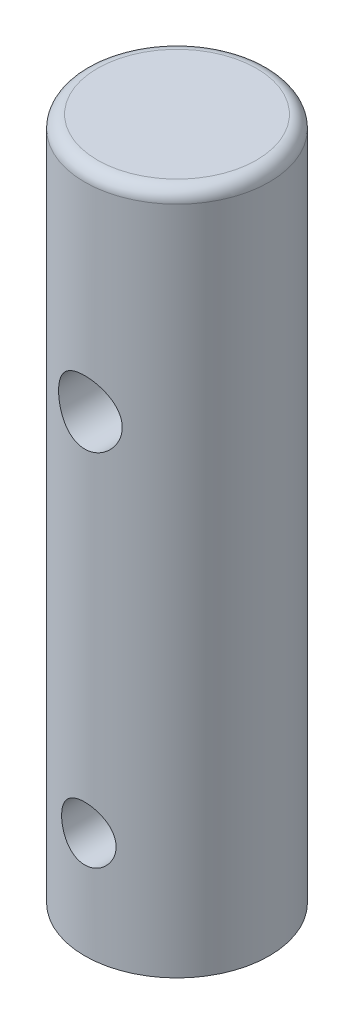
ISO-10303-21;
HEADER;
FILE_DESCRIPTION(('STEP AP214'),'2;1');
FILE_NAME('part.step','',(''),(''),'','','');
FILE_SCHEMA(('AUTOMOTIVE_DESIGN { 1 0 10303 214 1 1 1 1 }'));
ENDSEC;
DATA;
#1=APPLICATION_CONTEXT('core data for automotive mechanical design processes');
#2=APPLICATION_PROTOCOL_DEFINITION('international standard','automotive_design',2000,#1);
#3=PRODUCT_CONTEXT('',#1,'mechanical');
#4=PRODUCT('Part','Part','',(#3));
#5=PRODUCT_RELATED_PRODUCT_CATEGORY('part','',(#4));
#6=PRODUCT_DEFINITION_FORMATION('','',#4);
#7=PRODUCT_DEFINITION_CONTEXT('part definition',#1,'design');
#8=PRODUCT_DEFINITION('design','',#6,#7);
#9=PRODUCT_DEFINITION_SHAPE('','',#8);
#10=(LENGTH_UNIT() NAMED_UNIT(*) SI_UNIT(.MILLI.,.METRE.));
#11=(NAMED_UNIT(*) PLANE_ANGLE_UNIT() SI_UNIT($,.RADIAN.));
#12=(NAMED_UNIT(*) SI_UNIT($,.STERADIAN.) SOLID_ANGLE_UNIT());
#13=UNCERTAINTY_MEASURE_WITH_UNIT(LENGTH_MEASURE(1.E-05),#10,'distance_accuracy_value','');
#14=(GEOMETRIC_REPRESENTATION_CONTEXT(3) GLOBAL_UNCERTAINTY_ASSIGNED_CONTEXT((#13)) GLOBAL_UNIT_ASSIGNED_CONTEXT((#10,
#11,#12)) REPRESENTATION_CONTEXT('',''));
#15=CARTESIAN_POINT('',(0.,0.,0.));
#16=DIRECTION('',(0.,0.,1.));
#17=DIRECTION('',(1.,0.,0.));
#18=AXIS2_PLACEMENT_3D('',#15,#16,#17);
#19=CARTESIAN_POINT('',(0.,40.894,0.));
#20=DIRECTION('',(0.,-1.,0.));
#21=DIRECTION('',(0.,0.,-1.));
#22=AXIS2_PLACEMENT_3D('',#19,#20,#21);
#23=CYLINDRICAL_SURFACE('',#22,5.5245);
#24=CARTESIAN_POINT('',(0.,40.132,0.));
#25=DIRECTION('',(0.,1.,0.));
#26=DIRECTION('',(0.,0.,1.));
#27=AXIS2_PLACEMENT_3D('',#24,#25,#26);
#28=CIRCLE('',#27,5.5245);
#29=CARTESIAN_POINT('',(0.,40.132,5.5245));
#30=VERTEX_POINT('',#29);
#31=EDGE_CURVE('E10',#30,#30,#28,.F.);
#32=ORIENTED_EDGE('',*,*,#31,.T.);
#33=EDGE_LOOP('',(#32));
#34=FACE_BOUND('',#33,.T.);
#35=CARTESIAN_POINT('',(0.,7.98195,-5.5245));
#36=CARTESIAN_POINT('',(-0.0895903484566236,7.98194874623388,-5.52449912660964));
#37=CARTESIAN_POINT('',(-0.179193412250744,7.97454803541203,-5.52229975764123));
#38=CARTESIAN_POINT('',(-0.355794227506304,7.94520838994903,-5.51374071132154));
#39=CARTESIAN_POINT('',(-0.442791124452737,7.92326474031101,-5.50737968471904));
#40=CARTESIAN_POINT('',(-0.611606634543519,7.86563289288612,-5.49119505767326));
#41=CARTESIAN_POINT('',(-0.69343255204608,7.8299646112906,-5.48137647632618));
#42=CARTESIAN_POINT('',(-0.849942205269403,7.74597655108171,-5.45929970758308));
#43=CARTESIAN_POINT('',(-0.924625054389767,7.69765520474004,-5.44704121792499));
#44=CARTESIAN_POINT('',(-1.06681399348117,7.58831050966325,-5.42101173660955));
#45=CARTESIAN_POINT('',(-1.13409241968527,7.5269983359635,-5.40721046505941));
#46=CARTESIAN_POINT('',(-1.25757732244764,7.39402824090718,-5.37983346958253));
#47=CARTESIAN_POINT('',(-1.31378200386905,7.32236864541348,-5.3662577825508));
#48=CARTESIAN_POINT('',(-1.41470912789974,7.16882735481731,-5.34055027390758));
#49=CARTESIAN_POINT('',(-1.45915601002866,7.08675761986931,-5.3284561665612));
#50=CARTESIAN_POINT('',(-1.53352546951408,6.91589382022782,-5.30753267185843));
#51=CARTESIAN_POINT('',(-1.5634514150758,6.8271013204432,-5.2987025275225));
#52=CARTESIAN_POINT('',(-1.60711292071461,6.6478641761065,-5.28562186768113));
#53=CARTESIAN_POINT('',(-1.62126723149235,6.55753039045753,-5.28125317486328));
#54=CARTESIAN_POINT('',(-1.63429101074565,6.37567283272877,-5.2772382670734));
#55=CARTESIAN_POINT('',(-1.63316405629336,6.28414934414841,-5.27759094691184));
#56=CARTESIAN_POINT('',(-1.61598671093425,6.10589531509218,-5.28287404723522));
#57=CARTESIAN_POINT('',(-1.60045826886659,6.01910895050689,-5.2876443522315));
#58=CARTESIAN_POINT('',(-1.55576098148209,5.849432539313,-5.30096656046743));
#59=CARTESIAN_POINT('',(-1.52659082695092,5.76654286751596,-5.30951882666292));
#60=CARTESIAN_POINT('',(-1.45504791724168,5.60572409361142,-5.32957095765642));
#61=CARTESIAN_POINT('',(-1.41250393047487,5.52787608935636,-5.34110868713405));
#62=CARTESIAN_POINT('',(-1.31554008654386,5.38024806309769,-5.36581322533797));
#63=CARTESIAN_POINT('',(-1.26111742700479,5.31046995086757,-5.37898041816358));
#64=CARTESIAN_POINT('',(-1.13933778201114,5.17799878037697,-5.40611212787313));
#65=CARTESIAN_POINT('',(-1.07154687298471,5.11570615040467,-5.42008735932689));
#66=CARTESIAN_POINT('',(-0.926307084519885,5.00328188245886,-5.44678802250402));
#67=CARTESIAN_POINT('',(-0.84885763390005,4.95315096421471,-5.45951338023343));
#68=CARTESIAN_POINT('',(-0.68578714756461,4.86623991525815,-5.48239077524258));
#69=CARTESIAN_POINT('',(-0.600117521736954,4.82954624011543,-5.49252602594894));
#70=CARTESIAN_POINT('',(-0.423454618141935,4.77120493356093,-5.5089602865092));
#71=CARTESIAN_POINT('',(-0.332462785577033,4.749553237996,-5.51526033253006));
#72=CARTESIAN_POINT('',(-0.151144405794774,4.72257164333591,-5.52315147973728));
#73=CARTESIAN_POINT('',(-0.0609053434504533,4.71669881288859,-5.52489915521533));
#74=CARTESIAN_POINT('',(0.119273647976084,4.71992312878111,-5.52394667327806));
#75=CARTESIAN_POINT('',(0.209213614159698,4.7290183432845,-5.52124708984394));
#76=CARTESIAN_POINT('',(0.384208223187774,4.76148053968159,-5.51180574576735));
#77=CARTESIAN_POINT('',(0.469326604712223,4.78453235260241,-5.50515330870802));
#78=CARTESIAN_POINT('',(0.634470770225199,4.8438761111199,-5.48857364613341));
#79=CARTESIAN_POINT('',(0.714495947756585,4.88016962997969,-5.47864603150374));
#80=CARTESIAN_POINT('',(0.869196035704718,4.9658915344128,-5.45626704640769));
#81=CARTESIAN_POINT('',(0.943708592248774,5.0155989533069,-5.44376357925183));
#82=CARTESIAN_POINT('',(1.08352063021712,5.12639696315597,-5.41767015135985));
#83=CARTESIAN_POINT('',(1.14881786464982,5.18749032197106,-5.40407992689854));
#84=CARTESIAN_POINT('',(1.27072204184429,5.32187517857024,-5.3767471625881));
#85=CARTESIAN_POINT('',(1.32694305248801,5.39551983501265,-5.36301604731576));
#86=CARTESIAN_POINT('',(1.42625325065587,5.55149604456448,-5.33746576977812));
#87=CARTESIAN_POINT('',(1.46934282339433,5.6338273427535,-5.32564655143158));
#88=CARTESIAN_POINT('',(1.54086484539621,5.80454940111917,-5.30539529477114));
#89=CARTESIAN_POINT('',(1.56936900727342,5.89290804543329,-5.29694672995955));
#90=CARTESIAN_POINT('',(1.61101392076986,6.07346558847513,-5.28443150847732));
#91=CARTESIAN_POINT('',(1.6241597349503,6.16566321137897,-5.28036340791204));
#92=CARTESIAN_POINT('',(1.63437785206429,6.34728108697358,-5.27720894785441));
#93=CARTESIAN_POINT('',(1.6320779140555,6.43666311229575,-5.27792801377349));
#94=CARTESIAN_POINT('',(1.61296218494905,6.6137052166403,-5.28380081233532));
#95=CARTESIAN_POINT('',(1.59614694254768,6.70136536062381,-5.28895437734856));
#96=CARTESIAN_POINT('',(1.54887757067411,6.87148343103543,-5.30298699744919));
#97=CARTESIAN_POINT('',(1.5185848630738,6.95399012135764,-5.31182188352508));
#98=CARTESIAN_POINT('',(1.44534578337402,7.112815766237,-5.33221476271967));
#99=CARTESIAN_POINT('',(1.40239704715864,7.18913356132381,-5.34377326452239));
#100=CARTESIAN_POINT('',(1.30328174668514,7.33634035236967,-5.36882240205386));
#101=CARTESIAN_POINT('',(1.24670065709829,7.40694106629977,-5.38236699835942));
#102=CARTESIAN_POINT('',(1.12267894761893,7.53784923570666,-5.40959488469815));
#103=CARTESIAN_POINT('',(1.05523553958618,7.59815404022009,-5.4232782094929));
#104=CARTESIAN_POINT('',(0.90912476711559,7.7084410748599,-5.44970175685318));
#105=CARTESIAN_POINT('',(0.830195669922848,7.75808637249882,-5.46240476727729));
#106=CARTESIAN_POINT('',(0.664735691745805,7.84333111593935,-5.48499589435999));
#107=CARTESIAN_POINT('',(0.578208590267892,7.87893749732299,-5.49488540028732));
#108=CARTESIAN_POINT('',(0.410309959670478,7.93168767932821,-5.50981071016908));
#109=CARTESIAN_POINT('',(0.329493165368894,7.95048607989755,-5.51527447789911));
#110=CARTESIAN_POINT('',(0.165787660001949,7.9756168500716,-5.52261924805068));
#111=CARTESIAN_POINT('',(0.0828992734842595,7.98195116012833,-5.524500808161));
#112=CARTESIAN_POINT('',(0.,7.98195,-5.5245));
#113=B_SPLINE_CURVE_WITH_KNOTS('',3,(#35,#36,#37,#38,#39,#40,#41,#42,#43,#44,#45,#46,#47,#48,
#49,#50,#51,#52,#53,#54,#55,#56,#57,#58,#59,#60,#61,#62,#63,#64,#65,#66,#67,#68,#69,#70,#71,#72,
#73,#74,#75,#76,#77,#78,#79,#80,#81,#82,#83,#84,#85,#86,#87,#88,#89,#90,#91,#92,#93,#94,#95,#96,
#97,#98,#99,#100,#101,#102,#103,#104,#105,#106,#107,#108,#109,#110,#111,#112),.UNSPECIFIED.,.T.,
.F.,(4,2,2,2,2,2,2,2,2,2,2,2,2,2,2,2,2,2,2,2,2,2,2,2,2,2,2,2,2,2,2,2,2,2,2,2,2,2,4),(0.,
0.268466610030114,0.537020302794149,0.805185750697699,1.0733844403228,1.34832660222849,
1.62331329771028,1.90426581536578,2.18515313346344,2.45839042798023,2.73156376361527,
2.99520793368555,3.25887741125154,3.52607060424427,3.79332690078291,4.07138671690104,
4.34946298457029,4.62929821029588,4.90905779863716,5.17905996078972,5.44902727810326,
5.71311442386434,5.977232956362,6.24733717515489,6.51750714066475,6.79716935210383,
7.07682335878568,7.35508883995923,7.6332625707779,7.90020095003521,8.1671292391364,
8.43094312171328,8.69480631536583,8.96802156862362,9.24130706287506,9.52225694516128,
9.80306785662084,10.0515226619053,10.2999387838389),.UNSPECIFIED.);
#114=CARTESIAN_POINT('',(0.,7.98195,-5.5245));
#115=VERTEX_POINT('',#114);
#116=EDGE_CURVE('E43',#115,#115,#113,.T.);
#117=ORIENTED_EDGE('',*,*,#116,.T.);
#118=EDGE_LOOP('',(#117));
#119=FACE_BOUND('',#118,.T.);
#120=CARTESIAN_POINT('',(1.63195,6.35,5.27795788610519));
#121=CARTESIAN_POINT('',(1.63194871591318,6.26050591451628,5.27795892790005));
#122=CARTESIAN_POINT('',(1.6245633397231,6.17099906953886,5.28025901185322));
#123=CARTESIAN_POINT('',(1.59529011946661,5.9945976039874,5.28917544304377));
#124=CARTESIAN_POINT('',(1.57339708958734,5.90770392911531,5.29579333368359));
#125=CARTESIAN_POINT('',(1.51591310350462,5.73910769452066,5.31253186673363));
#126=CARTESIAN_POINT('',(1.4803444135311,5.65739694676972,5.32264681267672));
#127=CARTESIAN_POINT('',(1.39659149463591,5.50108335131985,5.34523211331702));
#128=CARTESIAN_POINT('',(1.34840550284489,5.42648149885264,5.35770279708629));
#129=CARTESIAN_POINT('',(1.2392030677595,5.28421432601246,5.38402354564152));
#130=CARTESIAN_POINT('',(1.17786728349863,5.21679938131826,5.39790231224437));
#131=CARTESIAN_POINT('',(1.04479107324454,5.0930472680534,5.42522989743095));
#132=CARTESIAN_POINT('',(0.973049351520346,5.0367114811031,5.43867866221663));
#133=CARTESIAN_POINT('',(0.81942310534368,4.93563588571631,5.4639561329141));
#134=CARTESIAN_POINT('',(0.73736446703589,4.8911504445118,5.47574707164456));
#135=CARTESIAN_POINT('',(0.566523866982605,4.81670677406207,5.49604750442944));
#136=CARTESIAN_POINT('',(0.477743313435837,4.78674551177564,5.50455768351909));
#137=CARTESIAN_POINT('',(0.298597623046899,4.74302662322739,5.51713466692468));
#138=CARTESIAN_POINT('',(0.208345086810036,4.7288418337936,5.52131838109605));
#139=CARTESIAN_POINT('',(0.0266507058113973,4.71572882602096,5.52518233090336));
#140=CARTESIAN_POINT('',(-0.0647908926992139,4.71679749747084,5.52486348462054));
#141=CARTESIAN_POINT('',(-0.243274362930353,4.73387231080294,5.51984131596145));
#142=CARTESIAN_POINT('',(-0.330364890912533,4.74941603314282,5.51527372882148));
#143=CARTESIAN_POINT('',(-0.500641164643062,4.79424555884894,5.5024315647984));
#144=CARTESIAN_POINT('',(-0.583826665724363,4.8235322220099,5.49415675598316));
#145=CARTESIAN_POINT('',(-0.745042411083746,4.89533523645022,5.47464030537969));
#146=CARTESIAN_POINT('',(-0.823002922966755,4.93799887019373,5.4633658573528));
#147=CARTESIAN_POINT('',(-0.970807507580377,5.03522879771068,5.43904879005752));
#148=CARTESIAN_POINT('',(-1.04064969613684,5.08979784617996,5.42600576183672));
#149=CARTESIAN_POINT('',(-1.1729951441578,5.21169625482392,5.39897387241012));
#150=CARTESIAN_POINT('',(-1.23512594958628,5.27942671891171,5.38496788180068));
#151=CARTESIAN_POINT('',(-1.34725065875311,5.42448353791637,5.35801736696297));
#152=CARTESIAN_POINT('',(-1.39724343139963,5.50181078610302,5.34507294173185));
#153=CARTESIAN_POINT('',(-1.48404570320968,5.66482142805944,5.32163105962882));
#154=CARTESIAN_POINT('',(-1.52073182191332,5.75057410044348,5.31115680368143));
#155=CARTESIAN_POINT('',(-1.57903411158477,5.9274208254621,5.29411793018789));
#156=CARTESIAN_POINT('',(-1.6006550233692,6.01851318797703,5.28755208281335));
#157=CARTESIAN_POINT('',(-1.62752488296492,6.19991744144195,5.27934224137501));
#158=CARTESIAN_POINT('',(-1.63333848327512,6.29013808855313,5.2775285841798));
#159=CARTESIAN_POINT('',(-1.63000250265282,6.47026737624436,5.27856001952958));
#160=CARTESIAN_POINT('',(-1.62085494061794,6.56017605728129,5.28140448349583));
#161=CARTESIAN_POINT('',(-1.58835848685411,6.73480059684204,5.29126550891064));
#162=CARTESIAN_POINT('',(-1.56536969626467,6.81959005193391,5.29817618124108));
#163=CARTESIAN_POINT('',(-1.50625904925677,6.98410377363539,5.31528215511218));
#164=CARTESIAN_POINT('',(-1.47013520755283,7.0638272724146,5.32547795315365));
#165=CARTESIAN_POINT('',(-1.38469815016392,7.21825203695587,5.34833712946574));
#166=CARTESIAN_POINT('',(-1.33506458029722,7.29276732903163,5.3610580892636));
#167=CARTESIAN_POINT('',(-1.22439977534567,7.43261792414598,5.38740892748522));
#168=CARTESIAN_POINT('',(-1.16336589622205,7.4979510914301,5.40103901628806));
#169=CARTESIAN_POINT('',(-1.02898443236943,7.62003435169869,5.42827335310787));
#170=CARTESIAN_POINT('',(-0.955269237884568,7.67638501894547,5.44185856775854));
#171=CARTESIAN_POINT('',(-0.799107375259904,7.77592417689184,5.46697105330423));
#172=CARTESIAN_POINT('',(-0.716661150068679,7.81911333487941,5.47849842851934));
#173=CARTESIAN_POINT('',(-0.545932571746386,7.89068746423351,5.49812485231129));
#174=CARTESIAN_POINT('',(-0.457699986409023,7.91918375047989,5.50624958872025));
#175=CARTESIAN_POINT('',(-0.27741633842667,7.96085511751541,5.51826876794883));
#176=CARTESIAN_POINT('',(-0.185366339341048,7.97403443641597,5.52216438092144));
#177=CARTESIAN_POINT('',(-0.00375757097659265,7.98438345665582,5.52521742366275));
#178=CARTESIAN_POINT('',(0.0857656716771738,7.98213328723478,5.52454655451611));
#179=CARTESIAN_POINT('',(0.263103887381965,7.96306828444866,5.51894433518966));
#180=CARTESIAN_POINT('',(0.350918952011846,7.94625423409515,5.5140132140578));
#181=CARTESIAN_POINT('',(0.521484671141302,7.89889375601246,5.50049147362221));
#182=CARTESIAN_POINT('',(0.604277630939451,7.86848822322299,5.49193844722668));
#183=CARTESIAN_POINT('',(0.763631087258833,7.79493360799818,5.47205839436313));
#184=CARTESIAN_POINT('',(0.840190575215811,7.75178246855334,5.46073092017828));
#185=CARTESIAN_POINT('',(0.987505439658357,7.6523954068733,5.43605456380289));
#186=CARTESIAN_POINT('',(1.05800439510911,7.59579245288769,5.42265354020176));
#187=CARTESIAN_POINT('',(1.18869765551812,7.47177446429377,5.39551316682216));
#188=CARTESIAN_POINT('',(1.24888902272271,7.40435635783982,5.3817737218626));
#189=CARTESIAN_POINT('',(1.35898640387451,7.25830396551357,5.35505028331633));
#190=CARTESIAN_POINT('',(1.40854853975222,7.17940378349505,5.34209918817437));
#191=CARTESIAN_POINT('',(1.49364480070804,7.01402081562797,5.31893616620705));
#192=CARTESIAN_POINT('',(1.52918603580933,6.92754190023069,5.30872285189262));
#193=CARTESIAN_POINT('',(1.58181515739795,6.75979337009101,5.29326205910347));
#194=CARTESIAN_POINT('',(1.60056508941322,6.67908270025868,5.28757605034786));
#195=CARTESIAN_POINT('',(1.62563195034804,6.51558473511371,5.27992382729788));
#196=CARTESIAN_POINT('',(1.631951188007,6.43279782831156,5.27795692226103));
#197=CARTESIAN_POINT('',(1.63195,6.35,5.27795788610519));
#198=B_SPLINE_CURVE_WITH_KNOTS('',3,(#120,#121,#122,#123,#124,#125,#126,#127,#128,#129,#130,
#131,#132,#133,#134,#135,#136,#137,#138,#139,#140,#141,#142,#143,#144,#145,#146,#147,#148,#149,
#150,#151,#152,#153,#154,#155,#156,#157,#158,#159,#160,#161,#162,#163,#164,#165,#166,#167,#168,
#169,#170,#171,#172,#173,#174,#175,#176,#177,#178,#179,#180,#181,#182,#183,#184,#185,#186,#187,
#188,#189,#190,#191,#192,#193,#194,#195,#196,#197),.UNSPECIFIED.,.T.,.F.,(4,2,2,2,2,2,2,2,2,2,2,
2,2,2,2,2,2,2,2,2,2,2,2,2,2,2,2,2,2,2,2,2,2,2,2,2,2,2,4),(0.,0.268176973099012,
0.536449858766199,0.804287789051371,1.0721631612129,1.34748268427948,1.62283651917741,
1.90369570789392,2.18449622032612,2.45749323372487,2.73043458328005,2.9949451135921,
3.25947219458896,3.52702057260831,3.79463092222118,4.07225598238307,4.34990690332687,
4.63007011776389,4.91014512876559,5.18007536532763,5.4499691798166,5.71312760461904,
5.97632582080951,6.24641026553113,6.5165574280631,6.79654681622781,7.07652200657952,
7.35434369818986,7.63208849991792,7.89944926490245,8.16679565641209,8.43143267868679,
8.69611243400635,8.96907036478853,9.242105961981,9.52295997866026,9.80367139013896,
10.0518285283885,10.2999395723279),.UNSPECIFIED.);
#199=CARTESIAN_POINT('',(1.63195,6.35,5.27795788610519));
#200=VERTEX_POINT('',#199);
#201=EDGE_CURVE('E47',#200,#200,#198,.T.);
#202=ORIENTED_EDGE('',*,*,#201,.T.);
#203=EDGE_LOOP('',(#202));
#204=FACE_BOUND('',#203,.T.);
#205=CARTESIAN_POINT('',(0.,30.099,-5.5245));
#206=CARTESIAN_POINT('',(-0.103737180981547,30.0990012395527,-5.52450084956603));
#207=CARTESIAN_POINT('',(-0.207465583562936,30.0904991386428,-5.52155153321799));
#208=CARTESIAN_POINT('',(-0.411854856824169,30.0568282203773,-5.51007768432061));
#209=CARTESIAN_POINT('',(-0.512515618944709,30.031658813905,-5.50155295470479));
#210=CARTESIAN_POINT('',(-0.707793557344557,29.9656271999771,-5.47985162327799));
#211=CARTESIAN_POINT('',(-0.802420924976506,29.9247923195255,-5.46668312531452));
#212=CARTESIAN_POINT('',(-0.98348220968848,29.8287165567469,-5.43702959098697));
#213=CARTESIAN_POINT('',(-1.06991433343753,29.7734725312014,-5.4205438311732));
#214=CARTESIAN_POINT('',(-1.23530833834173,29.6480171895628,-5.38530446703744));
#215=CARTESIAN_POINT('',(-1.31392782725894,29.5773706124171,-5.36649382058659));
#216=CARTESIAN_POINT('',(-1.45846873527436,29.4240404348232,-5.32902946280285));
#217=CARTESIAN_POINT('',(-1.52438708881665,29.3413539368443,-5.3103757903937));
#218=CARTESIAN_POINT('',(-1.6436669096613,29.1631394766149,-5.27470045660342));
#219=CARTESIAN_POINT('',(-1.6965731544954,29.0672916829937,-5.25774775145906));
#220=CARTESIAN_POINT('',(-1.78536686669964,28.8673801294271,-5.22826649107532));
#221=CARTESIAN_POINT('',(-1.82125994614864,28.7633190919897,-5.21573647728552));
#222=CARTESIAN_POINT('',(-1.8737059366251,28.5538432472162,-5.19712233131006));
#223=CARTESIAN_POINT('',(-1.89090384074158,28.4486095484114,-5.19082395310311));
#224=CARTESIAN_POINT('',(-1.90748801058109,28.2365761667221,-5.1847541194054));
#225=CARTESIAN_POINT('',(-1.90688024578914,28.1297770206675,-5.18498047644743));
#226=CARTESIAN_POINT('',(-1.88836906447642,27.9232463050546,-5.19174757976905));
#227=CARTESIAN_POINT('',(-1.87132071621634,27.8234260611836,-5.19797614225485));
#228=CARTESIAN_POINT('',(-1.82181215406091,27.6281607803308,-5.21553290257024));
#229=CARTESIAN_POINT('',(-1.78934997283175,27.5327163035526,-5.22686175136173));
#230=CARTESIAN_POINT('',(-1.70940013084516,27.3470228764737,-5.25355564780942));
#231=CARTESIAN_POINT('',(-1.66166766523131,27.2568890786218,-5.26898570982962));
#232=CARTESIAN_POINT('',(-1.55270223456137,27.0856461450256,-5.30211769254491));
#233=CARTESIAN_POINT('',(-1.49146515512412,27.004539770976,-5.31982030491786));
#234=CARTESIAN_POINT('',(-1.35317375822874,26.8488672796128,-5.35671679957416));
#235=CARTESIAN_POINT('',(-1.27542459931829,26.774923714826,-5.37593861605719));
#236=CARTESIAN_POINT('',(-1.10839606693567,26.6409559929805,-5.41284259542678));
#237=CARTESIAN_POINT('',(-1.01911542852975,26.580933364987,-5.43052458904728));
#238=CARTESIAN_POINT('',(-0.830167552368539,26.4759626446428,-5.46261794716368));
#239=CARTESIAN_POINT('',(-0.73039462154516,26.4311920186555,-5.4769902163931));
#240=CARTESIAN_POINT('',(-0.524117778016031,26.3592673426144,-5.5005595857146));
#241=CARTESIAN_POINT('',(-0.41761639116981,26.332106724391,-5.50975861514838));
#242=CARTESIAN_POINT('',(-0.206168072404254,26.2973006962432,-5.52162019519366));
#243=CARTESIAN_POINT('',(-0.101375085570262,26.2888148665079,-5.52456402292055));
#244=CARTESIAN_POINT('',(0.108165044494973,26.2891911836152,-5.52443389086509));
#245=CARTESIAN_POINT('',(0.212912192601245,26.2980501673909,-5.52136102830949));
#246=CARTESIAN_POINT('',(0.415952856583336,26.3322059442751,-5.50972864631611));
#247=CARTESIAN_POINT('',(0.514345739155183,26.3569777391298,-5.50134447653859));
#248=CARTESIAN_POINT('',(0.705531935786653,26.4215903860088,-5.48010804402616));
#249=CARTESIAN_POINT('',(0.798324526054864,26.4614331810197,-5.46725520519786));
#250=CARTESIAN_POINT('',(0.978500246177856,26.5562550632755,-5.43794085572731));
#251=CARTESIAN_POINT('',(1.06566688292694,26.6116172528879,-5.42139050253119));
#252=CARTESIAN_POINT('',(1.22974084985948,26.7354612840325,-5.38654659703826));
#253=CARTESIAN_POINT('',(1.3066448435013,26.803947374802,-5.36825248111538));
#254=CARTESIAN_POINT('',(1.45192096816156,26.9560420744742,-5.33084696798587));
#255=CARTESIAN_POINT('',(1.51969375459663,27.0402254864663,-5.31173924458298));
#256=CARTESIAN_POINT('',(1.64023651236718,27.219173868076,-5.27576479124797));
#257=CARTESIAN_POINT('',(1.69300609340269,27.3139391128847,-5.25889811962164));
#258=CARTESIAN_POINT('',(1.7818635333094,27.5115689382682,-5.22946124019048));
#259=CARTESIAN_POINT('',(1.81796260511015,27.6144280200996,-5.21688814592392));
#260=CARTESIAN_POINT('',(1.87214441585687,27.8253050416186,-5.19769351430158));
#261=CARTESIAN_POINT('',(1.89023603733216,27.9333204102829,-5.19106904282843));
#262=CARTESIAN_POINT('',(1.90716759945534,28.1450653387165,-5.18487078482502));
#263=CARTESIAN_POINT('',(1.9070093499749,28.2487048839046,-5.18493009399957));
#264=CARTESIAN_POINT('',(1.88993822235698,28.4543968983859,-5.19117660038333));
#265=CARTESIAN_POINT('',(1.87302648018758,28.5564494748067,-5.19736338212016));
#266=CARTESIAN_POINT('',(1.82365793638678,28.7538460511456,-5.21488547270641));
#267=CARTESIAN_POINT('',(1.79154762854783,28.8492877394389,-5.22610574509781));
#268=CARTESIAN_POINT('',(1.71297992924299,29.0334987333816,-5.25238114942318));
#269=CARTESIAN_POINT('',(1.66651921892281,29.1222664896226,-5.26743716831882));
#270=CARTESIAN_POINT('',(1.55807317647589,29.2950499034128,-5.30055273295031));
#271=CARTESIAN_POINT('',(1.4954707724034,29.3786576944726,-5.31871876212639));
#272=CARTESIAN_POINT('',(1.35753766340748,29.5345042544344,-5.3555842062857));
#273=CARTESIAN_POINT('',(1.28220324175553,29.6067396915932,-5.37428377569121));
#274=CARTESIAN_POINT('',(1.11707655217554,29.7409183797378,-5.41107059725149));
#275=CARTESIAN_POINT('',(1.02680341732561,29.802288653865,-5.42909736779209));
#276=CARTESIAN_POINT('',(0.836615897561365,29.9089279293699,-5.46163582441053));
#277=CARTESIAN_POINT('',(0.736703175023892,29.9541997006971,-5.47614811506155));
#278=CARTESIAN_POINT('',(0.532248056209571,30.0262741656069,-5.49974224238727));
#279=CARTESIAN_POINT('',(0.427851721962652,30.0534536453798,-5.50893430817121));
#280=CARTESIAN_POINT('',(0.21563301031218,30.0898129769723,-5.52131176391052));
#281=CARTESIAN_POINT('',(0.107811764387014,30.0989987117602,-5.52449911706476));
#282=CARTESIAN_POINT('',(0.,30.099,-5.5245));
#283=B_SPLINE_CURVE_WITH_KNOTS('',3,(#205,#206,#207,#208,#209,#210,#211,#212,#213,#214,#215,
#216,#217,#218,#219,#220,#221,#222,#223,#224,#225,#226,#227,#228,#229,#230,#231,#232,#233,#234,
#235,#236,#237,#238,#239,#240,#241,#242,#243,#244,#245,#246,#247,#248,#249,#250,#251,#252,#253,
#254,#255,#256,#257,#258,#259,#260,#261,#262,#263,#264,#265,#266,#267,#268,#269,#270,#271,#272,
#273,#274,#275,#276,#277,#278,#279,#280,#281,#282),.UNSPECIFIED.,.T.,.F.,(4,2,2,2,2,2,2,2,2,2,2,
2,2,2,2,2,2,2,2,2,2,2,2,2,2,2,2,2,2,2,2,2,2,2,2,2,2,2,4),(0.,0.310814545536888,
0.621640077602676,0.931925850130486,1.24227936524918,1.56291572643483,1.88362937998653,
2.21433544633063,2.54493234766553,2.86372113735481,3.18240305191713,3.48535713843162,
3.78834990267758,4.09646641590059,4.40467693140058,4.73018564923415,5.05573010378416,
5.38494250695113,5.71403204994103,6.02797975882087,6.34187022032327,6.64590237068894,
6.94997373091716,7.26233629355244,7.57480016388023,7.90250929861757,8.23022695774415,
8.55772386497277,8.88505914772957,9.19443470194468,9.50378928043196,9.80640801619715,
10.1090967918421,10.4257429035312,10.7424816106696,11.0727795705406,11.4030206709722,
11.7261490363915,12.049171738902),.UNSPECIFIED.);
#284=CARTESIAN_POINT('',(0.,30.099,-5.5245));
#285=VERTEX_POINT('',#284);
#286=EDGE_CURVE('E77',#285,#285,#283,.T.);
#287=ORIENTED_EDGE('',*,*,#286,.T.);
#288=EDGE_LOOP('',(#287));
#289=FACE_BOUND('',#288,.T.);
#290=CARTESIAN_POINT('',(1.905,28.194,5.18566054133897));
#291=CARTESIAN_POINT('',(1.90500127708764,28.0904701970197,5.18565949394141));
#292=CARTESIAN_POINT('',(1.89653186725822,27.9869492497988,5.18879478453826));
#293=CARTESIAN_POINT('',(1.86300261478983,27.7829888772564,5.20092616825529));
#294=CARTESIAN_POINT('',(1.83794097991304,27.6825497860534,5.20992289450689));
#295=CARTESIAN_POINT('',(1.77222401215808,27.4877438649286,5.23263952022008));
#296=CARTESIAN_POINT('',(1.73160099474033,27.393364921341,5.24634962565845));
#297=CARTESIAN_POINT('',(1.63602598572633,27.2127292103621,5.27693358437506));
#298=CARTESIAN_POINT('',(1.58107049765506,27.1264744318985,5.29380820937043));
#299=CARTESIAN_POINT('',(1.45592359884378,26.9609209035406,5.3296127565201));
#300=CARTESIAN_POINT('',(1.38523188641722,26.8820118810924,5.34859646133834));
#301=CARTESIAN_POINT('',(1.23168528637625,26.7369008123142,5.38602721665717));
#302=CARTESIAN_POINT('',(1.14882829166449,26.6707009718811,5.40447417352537));
#303=CARTESIAN_POINT('',(0.970424546668145,26.5510905739849,5.43938003133392));
#304=CARTESIAN_POINT('',(0.874586279031975,26.4980924076312,5.45576836637465));
#305=CARTESIAN_POINT('',(0.674691867512246,26.409126468823,5.48407341669026));
#306=CARTESIAN_POINT('',(0.570638114565932,26.3731537626419,5.49599142719112));
#307=CARTESIAN_POINT('',(0.36135567057161,26.3205933814713,5.51363183684676));
#308=CARTESIAN_POINT('',(0.25631317300463,26.3033371961865,5.51956732016141));
#309=CARTESIAN_POINT('',(0.0446670019365094,26.286569737795,5.52533249562962));
#310=CARTESIAN_POINT('',(-0.0619362334616299,26.2870535769869,5.52516386957718));
#311=CARTESIAN_POINT('',(-0.268930280453204,26.305337567289,5.51888189475234));
#312=CARTESIAN_POINT('',(-0.369394143772258,26.3224107095163,5.51301813394521));
#313=CARTESIAN_POINT('',(-0.565931925465535,26.3721809533765,5.49632181657193));
#314=CARTESIAN_POINT('',(-0.662005540979479,26.4048791311219,5.48548891777819));
#315=CARTESIAN_POINT('',(-0.8485753380077,26.4853719678167,5.45976339791379));
#316=CARTESIAN_POINT('',(-0.93897796923581,26.533365765125,5.44481760164657));
#317=CARTESIAN_POINT('',(-1.11065483075705,26.6429204572931,5.41241069993361));
#318=CARTESIAN_POINT('',(-1.19192639166674,26.7044853040234,5.39494886233422));
#319=CARTESIAN_POINT('',(-1.34734974456883,26.8430565515022,5.35830615580524));
#320=CARTESIAN_POINT('',(-1.42093992434623,26.9206826038585,5.33908299470158));
#321=CARTESIAN_POINT('',(-1.55424779355358,27.087326210461,5.30181259954549));
#322=CARTESIAN_POINT('',(-1.61396302121864,27.1763457818649,5.28376557457721));
#323=CARTESIAN_POINT('',(-1.71867841766107,27.3651429507904,5.25064960680842));
#324=CARTESIAN_POINT('',(-1.76342458122981,27.4650714421986,5.23563363441342));
#325=CARTESIAN_POINT('',(-1.83525779462244,27.6716950988947,5.21089144053423));
#326=CARTESIAN_POINT('',(-1.86235287315697,27.7783871634604,5.20116281440047));
#327=CARTESIAN_POINT('',(-1.89693615897598,27.9900375939137,5.18864697985387));
#328=CARTESIAN_POINT('',(-1.90530108047038,28.0948343521382,5.18554970062445));
#329=CARTESIAN_POINT('',(-1.90468248152413,28.3043575760829,5.18577742064397));
#330=CARTESIAN_POINT('',(-1.89570240257783,28.4090840516239,5.18910114587448));
#331=CARTESIAN_POINT('',(-1.86143861933443,28.611376409004,5.20148564388382));
#332=CARTESIAN_POINT('',(-1.83678158928811,28.7090634302166,5.21032566541868));
#333=CARTESIAN_POINT('',(-1.77262536625558,28.8988879749794,5.23249878196445));
#334=CARTESIAN_POINT('',(-1.73312342814274,28.9910244684651,5.24583270794298));
#335=CARTESIAN_POINT('',(-1.63890449531533,29.1705422379829,5.27604120688781));
#336=CARTESIAN_POINT('',(-1.5837238434617,29.2576623039519,5.29301906595356));
#337=CARTESIAN_POINT('',(-1.46023050315929,29.4217219806191,5.32840941291429));
#338=CARTESIAN_POINT('',(-1.39191368558132,29.4986583773823,5.3468223508167));
#339=CARTESIAN_POINT('',(-1.23986747827502,29.6443109506897,5.38416751415697));
#340=CARTESIAN_POINT('',(-1.15552084058005,29.7123906179286,5.40307686600004));
#341=CARTESIAN_POINT('',(-0.976133900280436,29.8334801941855,5.43834596806363));
#342=CARTESIAN_POINT('',(-0.881093891520051,29.8864905171545,5.45470578831355));
#343=CARTESIAN_POINT('',(-0.683403573496958,29.9754766912246,5.48296988699878));
#344=CARTESIAN_POINT('',(-0.580802400846435,30.0115529407861,5.49490033570508));
#345=CARTESIAN_POINT('',(-0.370492847322319,30.0657745533675,5.51307124713451));
#346=CARTESIAN_POINT('',(-0.262786471791649,30.0839268967881,5.51931392486633));
#347=CARTESIAN_POINT('',(-0.0511262845843111,30.1011230133886,5.52522718978326));
#348=CARTESIAN_POINT('',(0.0527455310204179,30.1010777164397,5.52521107822894));
#349=CARTESIAN_POINT('',(0.258932856969949,30.0841524033802,5.51939201935254));
#350=CARTESIAN_POINT('',(0.361248507970452,30.0672739180477,5.51358959822644));
#351=CARTESIAN_POINT('',(0.55957537815378,30.0177771511153,5.4969729298301));
#352=CARTESIAN_POINT('',(0.655666900584119,29.985447490797,5.48625072314193));
#353=CARTESIAN_POINT('',(0.841092131735996,29.9062380546159,5.46090020319158));
#354=CARTESIAN_POINT('',(0.930424589218353,29.8593555928929,5.44627116895624));
#355=CARTESIAN_POINT('',(1.10355026069389,29.7502994621446,5.41390188699638));
#356=CARTESIAN_POINT('',(1.18699777727964,29.6876065510634,5.39606353768288));
#357=CARTESIAN_POINT('',(1.3424819025743,29.549574480957,5.35949937446));
#358=CARTESIAN_POINT('',(1.41451472833702,29.4742311464178,5.34077326899913));
#359=CARTESIAN_POINT('',(1.54826287039292,29.3091953856313,5.3035848134252));
#360=CARTESIAN_POINT('',(1.60940622339061,29.2190275928012,5.28516787658152));
#361=CARTESIAN_POINT('',(1.71564461842654,29.0291167299192,5.25164558373579));
#362=CARTESIAN_POINT('',(1.76074242355516,28.9293753122336,5.23653965774014));
#363=CARTESIAN_POINT('',(1.83253765281023,28.7252912596637,5.21184488130938));
#364=CARTESIAN_POINT('',(1.85961606793584,28.6210970384347,5.20214255474201));
#365=CARTESIAN_POINT('',(1.89584286565287,28.4092643913325,5.18905223642781));
#366=CARTESIAN_POINT('',(1.9049986723665,28.3016274103481,5.1856616301915));
#367=CARTESIAN_POINT('',(1.905,28.194,5.18566054133897));
#368=B_SPLINE_CURVE_WITH_KNOTS('',3,(#290,#291,#292,#293,#294,#295,#296,#297,#298,#299,#300,
#301,#302,#303,#304,#305,#306,#307,#308,#309,#310,#311,#312,#313,#314,#315,#316,#317,#318,#319,
#320,#321,#322,#323,#324,#325,#326,#327,#328,#329,#330,#331,#332,#333,#334,#335,#336,#337,#338,
#339,#340,#341,#342,#343,#344,#345,#346,#347,#348,#349,#350,#351,#352,#353,#354,#355,#356,#357,
#358,#359,#360,#361,#362,#363,#364,#365,#366,#367),.UNSPECIFIED.,.T.,.F.,(4,2,2,2,2,2,2,2,2,2,2,
2,2,2,2,2,2,2,2,2,2,2,2,2,2,2,2,2,2,2,2,2,2,2,2,2,2,2,4),(0.,0.310190255182593,
0.620414021568906,0.929997025568421,1.23965562458888,1.56110064208195,1.8826014015389,
2.21315074401711,2.54360423944619,2.86182086176442,3.179949810238,3.4847380489316,
3.78954728173151,4.09849921834654,4.40754124045814,4.73208487673403,5.05668605130458,
5.38654478211695,5.7162533695895,6.03017449181747,6.34403333403584,6.6460732967308,
6.94816914028804,7.26034396138474,7.57261707018864,7.9011480455949,8.22966999546816,
8.5562188102004,8.88264040145426,9.1927242598901,9.50277992246064,9.80725768760537,
10.1117916805117,10.4280508083999,10.7444145296067,11.0742883054177,11.4041052484728,
11.7267061876578,12.049173466832),.UNSPECIFIED.);
#369=CARTESIAN_POINT('',(1.905,28.194,5.18566054133897));
#370=VERTEX_POINT('',#369);
#371=EDGE_CURVE('E73',#370,#370,#368,.T.);
#372=ORIENTED_EDGE('',*,*,#371,.T.);
#373=EDGE_LOOP('',(#372));
#374=FACE_BOUND('',#373,.T.);
#375=CARTESIAN_POINT('',(0.,0.,0.));
#376=DIRECTION('',(0.,1.,0.));
#377=DIRECTION('',(0.,0.,1.));
#378=AXIS2_PLACEMENT_3D('',#375,#376,#377);
#379=CIRCLE('',#378,5.5245);
#380=CARTESIAN_POINT('',(0.,0.,5.5245));
#381=VERTEX_POINT('',#380);
#382=EDGE_CURVE('E85',#381,#381,#379,.T.);
#383=ORIENTED_EDGE('',*,*,#382,.T.);
#384=EDGE_LOOP('',(#383));
#385=FACE_BOUND('',#384,.T.);
#386=ADVANCED_FACE('F32',(#34,#119,#204,#289,#374,#385),#23,.T.);
#387=CARTESIAN_POINT('',(0.,40.894,0.));
#388=DIRECTION('',(0.,1.,0.));
#389=DIRECTION('',(0.,0.,1.));
#390=AXIS2_PLACEMENT_3D('',#387,#388,#389);
#391=PLANE('',#390);
#392=CARTESIAN_POINT('',(0.,40.894,0.));
#393=DIRECTION('',(0.,1.,0.));
#394=DIRECTION('',(0.,0.,1.));
#395=AXIS2_PLACEMENT_3D('',#392,#393,#394);
#396=CIRCLE('',#395,4.7625);
#397=CARTESIAN_POINT('',(0.,40.894,4.7625));
#398=VERTEX_POINT('',#397);
#399=EDGE_CURVE('E39',#398,#398,#396,.T.);
#400=ORIENTED_EDGE('',*,*,#399,.T.);
#401=EDGE_LOOP('',(#400));
#402=FACE_BOUND('',#401,.T.);
#403=ADVANCED_FACE('F70',(#402),#391,.T.);
#404=CARTESIAN_POINT('',(0.,0.,0.));
#405=DIRECTION('',(0.,1.,0.));
#406=DIRECTION('',(0.,0.,1.));
#407=AXIS2_PLACEMENT_3D('',#404,#405,#406);
#408=PLANE('',#407);
#409=ORIENTED_EDGE('',*,*,#382,.F.);
#410=EDGE_LOOP('',(#409));
#411=FACE_BOUND('',#410,.T.);
#412=ADVANCED_FACE('F68',(#411),#408,.F.);
#413=CARTESIAN_POINT('',(0.,28.194,-5.5245));
#414=DIRECTION('',(0.,0.,1.));
#415=DIRECTION('',(1.,0.,0.));
#416=AXIS2_PLACEMENT_3D('',#413,#414,#415);
#417=CYLINDRICAL_SURFACE('',#416,1.905);
#418=ORIENTED_EDGE('',*,*,#371,.F.);
#419=EDGE_LOOP('',(#418));
#420=FACE_BOUND('',#419,.T.);
#421=ORIENTED_EDGE('',*,*,#286,.F.);
#422=EDGE_LOOP('',(#421));
#423=FACE_BOUND('',#422,.T.);
#424=ADVANCED_FACE('F62',(#420,#423),#417,.F.);
#425=CARTESIAN_POINT('',(0.,6.35,-5.5245));
#426=DIRECTION('',(0.,0.,1.));
#427=DIRECTION('',(1.,0.,0.));
#428=AXIS2_PLACEMENT_3D('',#425,#426,#427);
#429=CYLINDRICAL_SURFACE('',#428,1.63195);
#430=ORIENTED_EDGE('',*,*,#201,.F.);
#431=EDGE_LOOP('',(#430));
#432=FACE_BOUND('',#431,.T.);
#433=ORIENTED_EDGE('',*,*,#116,.F.);
#434=EDGE_LOOP('',(#433));
#435=FACE_BOUND('',#434,.T.);
#436=ADVANCED_FACE('F58',(#432,#435),#429,.F.);
#437=CARTESIAN_POINT('',(0.,40.132,0.));
#438=DIRECTION('',(0.,1.,0.));
#439=DIRECTION('',(0.,0.,1.));
#440=AXIS2_PLACEMENT_3D('',#437,#438,#439);
#441=TOROIDAL_SURFACE('',#440,4.7625,0.762);
#442=ORIENTED_EDGE('',*,*,#31,.F.);
#443=EDGE_LOOP('',(#442));
#444=FACE_BOUND('',#443,.T.);
#445=ORIENTED_EDGE('',*,*,#399,.F.);
#446=EDGE_LOOP('',(#445));
#447=FACE_BOUND('',#446,.T.);
#448=ADVANCED_FACE('F34',(#444,#447),#441,.T.);
#449=CLOSED_SHELL('',(#386,#403,#412,#424,#436,#448));
#450=MANIFOLD_SOLID_BREP('B2',#449);
#451=ADVANCED_BREP_SHAPE_REPRESENTATION('',(#18,#450),#14);
#452=SHAPE_DEFINITION_REPRESENTATION(#9,#451);
ENDSEC;
END-ISO-10303-21;
